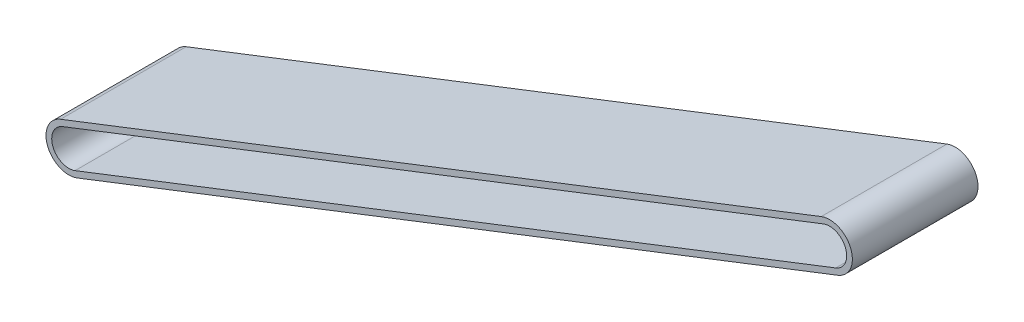
ISO-10303-21;
HEADER;
FILE_DESCRIPTION(('STEP AP214'),'2;1');
FILE_NAME('part.step','',(''),(''),'','','');
FILE_SCHEMA(('AUTOMOTIVE_DESIGN { 1 0 10303 214 1 1 1 1 }'));
ENDSEC;
DATA;
#1=APPLICATION_CONTEXT('core data for automotive mechanical design processes');
#2=APPLICATION_PROTOCOL_DEFINITION('international standard','automotive_design',2000,#1);
#3=PRODUCT_CONTEXT('',#1,'mechanical');
#4=PRODUCT('Part','Part','',(#3));
#5=PRODUCT_RELATED_PRODUCT_CATEGORY('part','',(#4));
#6=PRODUCT_DEFINITION_FORMATION('','',#4);
#7=PRODUCT_DEFINITION_CONTEXT('part definition',#1,'design');
#8=PRODUCT_DEFINITION('design','',#6,#7);
#9=PRODUCT_DEFINITION_SHAPE('','',#8);
#10=(LENGTH_UNIT() NAMED_UNIT(*) SI_UNIT(.MILLI.,.METRE.));
#11=(NAMED_UNIT(*) PLANE_ANGLE_UNIT() SI_UNIT($,.RADIAN.));
#12=(NAMED_UNIT(*) SI_UNIT($,.STERADIAN.) SOLID_ANGLE_UNIT());
#13=UNCERTAINTY_MEASURE_WITH_UNIT(LENGTH_MEASURE(1.E-05),#10,'distance_accuracy_value','');
#14=(GEOMETRIC_REPRESENTATION_CONTEXT(3) GLOBAL_UNCERTAINTY_ASSIGNED_CONTEXT((#13)) GLOBAL_UNIT_ASSIGNED_CONTEXT((#10,
#11,#12)) REPRESENTATION_CONTEXT('',''));
#15=CARTESIAN_POINT('',(0.,0.,0.));
#16=DIRECTION('',(0.,0.,1.));
#17=DIRECTION('',(1.,0.,0.));
#18=AXIS2_PLACEMENT_3D('',#15,#16,#17);
#19=CARTESIAN_POINT('',(0.,0.,139.7));
#20=DIRECTION('',(0.,0.,-1.));
#21=DIRECTION('',(-1.,0.,0.));
#22=AXIS2_PLACEMENT_3D('',#19,#20,#21);
#23=CYLINDRICAL_SURFACE('',#22,50.8);
#24=CARTESIAN_POINT('',(0.,0.,-139.7));
#25=DIRECTION('',(0.,0.,1.));
#26=DIRECTION('',(-1.,0.,0.));
#27=AXIS2_PLACEMENT_3D('',#24,#25,#26);
#28=CIRCLE('',#27,50.8);
#29=CARTESIAN_POINT('',(-18.4254337454408,47.3407159989408,-139.7));
#30=VERTEX_POINT('',#29);
#31=CARTESIAN_POINT('',(18.4254337454408,-47.3407159989408,-139.7));
#32=VERTEX_POINT('',#31);
#33=EDGE_CURVE('E154',#30,#32,#28,.T.);
#34=ORIENTED_EDGE('',*,*,#33,.T.);
#35=DIRECTION('',(0.,0.,-1.));
#36=VECTOR('',#35,1.);
#37=CARTESIAN_POINT('',(18.4254337454408,-47.3407159989408,139.7));
#38=LINE('',#37,#36);
#39=CARTESIAN_POINT('',(18.4254337454408,-47.3407159989408,139.7));
#40=VERTEX_POINT('',#39);
#41=EDGE_CURVE('E11',#40,#32,#38,.T.);
#42=ORIENTED_EDGE('',*,*,#41,.F.);
#43=CARTESIAN_POINT('',(0.,0.,139.7));
#44=DIRECTION('',(0.,0.,1.));
#45=DIRECTION('',(-1.,0.,0.));
#46=AXIS2_PLACEMENT_3D('',#43,#44,#45);
#47=CIRCLE('',#46,50.8);
#48=CARTESIAN_POINT('',(-18.4254337454408,47.3407159989408,139.7));
#49=VERTEX_POINT('',#48);
#50=EDGE_CURVE('E160',#49,#40,#47,.T.);
#51=ORIENTED_EDGE('',*,*,#50,.F.);
#52=DIRECTION('',(0.,0.,-1.));
#53=VECTOR('',#52,1.);
#54=CARTESIAN_POINT('',(-18.4254337454408,47.3407159989408,139.7));
#55=LINE('',#54,#53);
#56=EDGE_CURVE('E174',#49,#30,#55,.T.);
#57=ORIENTED_EDGE('',*,*,#56,.T.);
#58=EDGE_LOOP('',(#34,#42,#51,#57));
#59=FACE_BOUND('',#58,.T.);
#60=ADVANCED_FACE('F45',(#59),#23,.T.);
#61=CARTESIAN_POINT('',(1710.2036980068,611.114646628484,139.7));
#62=DIRECTION('',(-0.36270538868978,0.931903858246867,0.));
#63=DIRECTION('',(-0.931903858246867,-0.36270538868978,0.));
#64=AXIS2_PLACEMENT_3D('',#61,#62,#63);
#65=PLANE('',#64);
#66=DIRECTION('',(0.931903858246866,0.36270538868978,0.));
#67=VECTOR('',#66,1.);
#68=CARTESIAN_POINT('',(1710.2036980068,611.114646628484,-139.7));
#69=LINE('',#68,#67);
#70=CARTESIAN_POINT('',(1710.2036980068,611.114646628484,-139.7));
#71=VERTEX_POINT('',#70);
#72=EDGE_CURVE('E178',#32,#71,#69,.T.);
#73=ORIENTED_EDGE('',*,*,#72,.T.);
#74=DIRECTION('',(0.,0.,-1.));
#75=VECTOR('',#74,1.);
#76=CARTESIAN_POINT('',(1710.2036980068,611.114646628484,139.7));
#77=LINE('',#76,#75);
#78=CARTESIAN_POINT('',(1710.2036980068,611.114646628484,139.7));
#79=VERTEX_POINT('',#78);
#80=EDGE_CURVE('E53',#79,#71,#77,.T.);
#81=ORIENTED_EDGE('',*,*,#80,.F.);
#82=DIRECTION('',(0.931903858246866,0.36270538868978,0.));
#83=VECTOR('',#82,1.);
#84=CARTESIAN_POINT('',(1710.2036980068,611.114646628484,139.7));
#85=LINE('',#84,#83);
#86=EDGE_CURVE('E164',#40,#79,#85,.T.);
#87=ORIENTED_EDGE('',*,*,#86,.F.);
#88=ORIENTED_EDGE('',*,*,#41,.T.);
#89=EDGE_LOOP('',(#73,#81,#87,#88));
#90=FACE_BOUND('',#89,.T.);
#91=ADVANCED_FACE('F213',(#90),#65,.F.);
#92=CARTESIAN_POINT('',(1691.77826426136,658.455362627425,139.7));
#93=DIRECTION('',(0.,0.,-1.));
#94=DIRECTION('',(-1.,0.,0.));
#95=AXIS2_PLACEMENT_3D('',#92,#93,#94);
#96=CYLINDRICAL_SURFACE('',#95,50.8);
#97=CARTESIAN_POINT('',(1691.77826426136,658.455362627425,-139.7));
#98=DIRECTION('',(0.,0.,1.));
#99=DIRECTION('',(-1.,0.,0.));
#100=AXIS2_PLACEMENT_3D('',#97,#98,#99);
#101=CIRCLE('',#100,50.8);
#102=CARTESIAN_POINT('',(1673.35283051592,705.796078626366,-139.7));
#103=VERTEX_POINT('',#102);
#104=EDGE_CURVE('E181',#71,#103,#101,.T.);
#105=ORIENTED_EDGE('',*,*,#104,.T.);
#106=DIRECTION('',(0.,0.,-1.));
#107=VECTOR('',#106,1.);
#108=CARTESIAN_POINT('',(1673.35283051592,705.796078626366,139.7));
#109=LINE('',#108,#107);
#110=CARTESIAN_POINT('',(1673.35283051592,705.796078626366,139.7));
#111=VERTEX_POINT('',#110);
#112=EDGE_CURVE('E189',#111,#103,#109,.T.);
#113=ORIENTED_EDGE('',*,*,#112,.F.);
#114=CARTESIAN_POINT('',(1691.77826426136,658.455362627425,139.7));
#115=DIRECTION('',(0.,0.,1.));
#116=DIRECTION('',(-1.,0.,0.));
#117=AXIS2_PLACEMENT_3D('',#114,#115,#116);
#118=CIRCLE('',#117,50.8);
#119=EDGE_CURVE('E168',#79,#111,#118,.T.);
#120=ORIENTED_EDGE('',*,*,#119,.F.);
#121=ORIENTED_EDGE('',*,*,#80,.T.);
#122=EDGE_LOOP('',(#105,#113,#120,#121));
#123=FACE_BOUND('',#122,.T.);
#124=ADVANCED_FACE('F199',(#123),#96,.T.);
#125=CARTESIAN_POINT('',(-18.4254337454408,47.3407159989408,139.7));
#126=DIRECTION('',(0.36270538868978,-0.931903858246867,0.));
#127=DIRECTION('',(0.931903858246867,0.36270538868978,0.));
#128=AXIS2_PLACEMENT_3D('',#125,#126,#127);
#129=PLANE('',#128);
#130=DIRECTION('',(-0.931903858246866,-0.36270538868978,0.));
#131=VECTOR('',#130,1.);
#132=CARTESIAN_POINT('',(-18.4254337454408,47.3407159989408,-139.7));
#133=LINE('',#132,#131);
#134=EDGE_CURVE('E165',#103,#30,#133,.T.);
#135=ORIENTED_EDGE('',*,*,#134,.T.);
#136=ORIENTED_EDGE('',*,*,#56,.F.);
#137=DIRECTION('',(-0.931903858246866,-0.36270538868978,0.));
#138=VECTOR('',#137,1.);
#139=CARTESIAN_POINT('',(-18.4254337454408,47.3407159989408,139.7));
#140=LINE('',#139,#138);
#141=EDGE_CURVE('E171',#111,#49,#140,.T.);
#142=ORIENTED_EDGE('',*,*,#141,.F.);
#143=ORIENTED_EDGE('',*,*,#112,.T.);
#144=EDGE_LOOP('',(#135,#136,#142,#143));
#145=FACE_BOUND('',#144,.T.);
#146=ADVANCED_FACE('F206',(#145),#129,.F.);
#147=CARTESIAN_POINT('',(0.,0.,139.7));
#148=DIRECTION('',(0.,0.,-1.));
#149=DIRECTION('',(-1.,0.,0.));
#150=AXIS2_PLACEMENT_3D('',#147,#148,#149);
#151=PLANE('',#150);
#152=DIRECTION('',(0.931903858246867,0.36270538868978,0.));
#153=VECTOR('',#152,1.);
#154=CARTESIAN_POINT('',(13.8190753090806,-35.5055369992056,139.7));
#155=LINE('',#154,#153);
#156=CARTESIAN_POINT('',(13.8190753090806,-35.5055369992056,139.7));
#157=VERTEX_POINT('',#156);
#158=CARTESIAN_POINT('',(1705.59733957044,622.94982562822,139.7));
#159=VERTEX_POINT('',#158);
#160=EDGE_CURVE('E145',#157,#159,#155,.T.);
#161=ORIENTED_EDGE('',*,*,#160,.F.);
#162=CARTESIAN_POINT('',(0.,0.,139.7));
#163=DIRECTION('',(0.,0.,1.));
#164=DIRECTION('',(1.,0.,0.));
#165=AXIS2_PLACEMENT_3D('',#162,#163,#164);
#166=CIRCLE('',#165,38.1);
#167=CARTESIAN_POINT('',(-13.8190753090806,35.5055369992056,139.7));
#168=VERTEX_POINT('',#167);
#169=EDGE_CURVE('E60',#168,#157,#166,.T.);
#170=ORIENTED_EDGE('',*,*,#169,.F.);
#171=DIRECTION('',(-0.931903858246866,-0.36270538868978,0.));
#172=VECTOR('',#171,1.);
#173=CARTESIAN_POINT('',(1677.95918895228,693.960899626631,139.7));
#174=LINE('',#173,#172);
#175=CARTESIAN_POINT('',(1677.95918895228,693.960899626631,139.7));
#176=VERTEX_POINT('',#175);
#177=EDGE_CURVE('E131',#176,#168,#174,.T.);
#178=ORIENTED_EDGE('',*,*,#177,.F.);
#179=CARTESIAN_POINT('',(1691.77826426136,658.455362627425,139.7));
#180=DIRECTION('',(0.,0.,1.));
#181=DIRECTION('',(1.,0.,0.));
#182=AXIS2_PLACEMENT_3D('',#179,#180,#181);
#183=CIRCLE('',#182,38.1);
#184=EDGE_CURVE('E136',#159,#176,#183,.T.);
#185=ORIENTED_EDGE('',*,*,#184,.F.);
#186=EDGE_LOOP('',(#161,#170,#178,#185));
#187=FACE_BOUND('',#186,.T.);
#188=ORIENTED_EDGE('',*,*,#50,.T.);
#189=ORIENTED_EDGE('',*,*,#86,.T.);
#190=ORIENTED_EDGE('',*,*,#119,.T.);
#191=ORIENTED_EDGE('',*,*,#141,.T.);
#192=EDGE_LOOP('',(#188,#189,#190,#191));
#193=FACE_BOUND('',#192,.T.);
#194=ADVANCED_FACE('F212',(#187,#193),#151,.F.);
#195=CARTESIAN_POINT('',(0.,0.,-139.7));
#196=DIRECTION('',(0.,0.,-1.));
#197=DIRECTION('',(-1.,0.,0.));
#198=AXIS2_PLACEMENT_3D('',#195,#196,#197);
#199=PLANE('',#198);
#200=CARTESIAN_POINT('',(0.,0.,-139.7));
#201=DIRECTION('',(0.,0.,1.));
#202=DIRECTION('',(1.,0.,0.));
#203=AXIS2_PLACEMENT_3D('',#200,#201,#202);
#204=CIRCLE('',#203,38.1);
#205=CARTESIAN_POINT('',(-13.8190753090806,35.5055369992056,-139.7));
#206=VERTEX_POINT('',#205);
#207=CARTESIAN_POINT('',(13.8190753090806,-35.5055369992056,-139.7));
#208=VERTEX_POINT('',#207);
#209=EDGE_CURVE('E112',#206,#208,#204,.T.);
#210=ORIENTED_EDGE('',*,*,#209,.T.);
#211=DIRECTION('',(0.931903858246867,0.36270538868978,0.));
#212=VECTOR('',#211,1.);
#213=CARTESIAN_POINT('',(13.8190753090806,-35.5055369992056,-139.7));
#214=LINE('',#213,#212);
#215=CARTESIAN_POINT('',(1705.59733957044,622.94982562822,-139.7));
#216=VERTEX_POINT('',#215);
#217=EDGE_CURVE('E122',#208,#216,#214,.T.);
#218=ORIENTED_EDGE('',*,*,#217,.T.);
#219=CARTESIAN_POINT('',(1691.77826426136,658.455362627425,-139.7));
#220=DIRECTION('',(0.,0.,1.));
#221=DIRECTION('',(1.,0.,0.));
#222=AXIS2_PLACEMENT_3D('',#219,#220,#221);
#223=CIRCLE('',#222,38.1);
#224=CARTESIAN_POINT('',(1677.95918895228,693.960899626631,-139.7));
#225=VERTEX_POINT('',#224);
#226=EDGE_CURVE('E68',#216,#225,#223,.T.);
#227=ORIENTED_EDGE('',*,*,#226,.T.);
#228=DIRECTION('',(-0.931903858246866,-0.36270538868978,0.));
#229=VECTOR('',#228,1.);
#230=CARTESIAN_POINT('',(1677.95918895228,693.960899626631,-139.7));
#231=LINE('',#230,#229);
#232=EDGE_CURVE('E119',#225,#206,#231,.T.);
#233=ORIENTED_EDGE('',*,*,#232,.T.);
#234=EDGE_LOOP('',(#210,#218,#227,#233));
#235=FACE_BOUND('',#234,.T.);
#236=ORIENTED_EDGE('',*,*,#33,.F.);
#237=ORIENTED_EDGE('',*,*,#134,.F.);
#238=ORIENTED_EDGE('',*,*,#104,.F.);
#239=ORIENTED_EDGE('',*,*,#72,.F.);
#240=EDGE_LOOP('',(#236,#237,#238,#239));
#241=FACE_BOUND('',#240,.T.);
#242=ADVANCED_FACE('F127',(#235,#241),#199,.T.);
#243=CARTESIAN_POINT('',(0.,0.,-139.7));
#244=DIRECTION('',(0.,0.,1.));
#245=DIRECTION('',(1.,0.,0.));
#246=AXIS2_PLACEMENT_3D('',#243,#244,#245);
#247=CYLINDRICAL_SURFACE('',#246,38.1);
#248=ORIENTED_EDGE('',*,*,#169,.T.);
#249=DIRECTION('',(0.,0.,1.));
#250=VECTOR('',#249,1.);
#251=CARTESIAN_POINT('',(13.8190753090806,-35.5055369992056,-139.7));
#252=LINE('',#251,#250);
#253=EDGE_CURVE('E108',#208,#157,#252,.T.);
#254=ORIENTED_EDGE('',*,*,#253,.F.);
#255=ORIENTED_EDGE('',*,*,#209,.F.);
#256=DIRECTION('',(0.,0.,1.));
#257=VECTOR('',#256,1.);
#258=CARTESIAN_POINT('',(-13.8190753090806,35.5055369992056,-139.7));
#259=LINE('',#258,#257);
#260=EDGE_CURVE('E151',#206,#168,#259,.T.);
#261=ORIENTED_EDGE('',*,*,#260,.T.);
#262=EDGE_LOOP('',(#248,#254,#255,#261));
#263=FACE_BOUND('',#262,.T.);
#264=ADVANCED_FACE('F110',(#263),#247,.F.);
#265=CARTESIAN_POINT('',(1677.95918895228,693.960899626631,-139.7));
#266=DIRECTION('',(-0.36270538868978,0.931903858246867,0.));
#267=DIRECTION('',(-0.931903858246867,-0.36270538868978,0.));
#268=AXIS2_PLACEMENT_3D('',#265,#266,#267);
#269=PLANE('',#268);
#270=ORIENTED_EDGE('',*,*,#177,.T.);
#271=ORIENTED_EDGE('',*,*,#260,.F.);
#272=ORIENTED_EDGE('',*,*,#232,.F.);
#273=DIRECTION('',(0.,0.,1.));
#274=VECTOR('',#273,1.);
#275=CARTESIAN_POINT('',(1677.95918895228,693.960899626631,-139.7));
#276=LINE('',#275,#274);
#277=EDGE_CURVE('E155',#225,#176,#276,.T.);
#278=ORIENTED_EDGE('',*,*,#277,.T.);
#279=EDGE_LOOP('',(#270,#271,#272,#278));
#280=FACE_BOUND('',#279,.T.);
#281=ADVANCED_FACE('F230',(#280),#269,.F.);
#282=CARTESIAN_POINT('',(1691.77826426136,658.455362627425,-139.7));
#283=DIRECTION('',(0.,0.,1.));
#284=DIRECTION('',(1.,0.,0.));
#285=AXIS2_PLACEMENT_3D('',#282,#283,#284);
#286=CYLINDRICAL_SURFACE('',#285,38.1);
#287=ORIENTED_EDGE('',*,*,#184,.T.);
#288=ORIENTED_EDGE('',*,*,#277,.F.);
#289=ORIENTED_EDGE('',*,*,#226,.F.);
#290=DIRECTION('',(0.,0.,1.));
#291=VECTOR('',#290,1.);
#292=CARTESIAN_POINT('',(1705.59733957044,622.94982562822,-139.7));
#293=LINE('',#292,#291);
#294=EDGE_CURVE('E118',#216,#159,#293,.T.);
#295=ORIENTED_EDGE('',*,*,#294,.T.);
#296=EDGE_LOOP('',(#287,#288,#289,#295));
#297=FACE_BOUND('',#296,.T.);
#298=ADVANCED_FACE('F233',(#297),#286,.F.);
#299=CARTESIAN_POINT('',(13.8190753090806,-35.5055369992056,-139.7));
#300=DIRECTION('',(0.36270538868978,-0.931903858246867,0.));
#301=DIRECTION('',(0.931903858246867,0.36270538868978,0.));
#302=AXIS2_PLACEMENT_3D('',#299,#300,#301);
#303=PLANE('',#302);
#304=ORIENTED_EDGE('',*,*,#160,.T.);
#305=ORIENTED_EDGE('',*,*,#294,.F.);
#306=ORIENTED_EDGE('',*,*,#217,.F.);
#307=ORIENTED_EDGE('',*,*,#253,.T.);
#308=EDGE_LOOP('',(#304,#305,#306,#307));
#309=FACE_BOUND('',#308,.T.);
#310=ADVANCED_FACE('F123',(#309),#303,.F.);
#311=CLOSED_SHELL('',(#60,#91,#124,#146,#194,#242,#264,#281,#298,#310));
#312=MANIFOLD_SOLID_BREP('B2',#311);
#313=ADVANCED_BREP_SHAPE_REPRESENTATION('',(#18,#312),#14);
#314=SHAPE_DEFINITION_REPRESENTATION(#9,#313);
ENDSEC;
END-ISO-10303-21;
